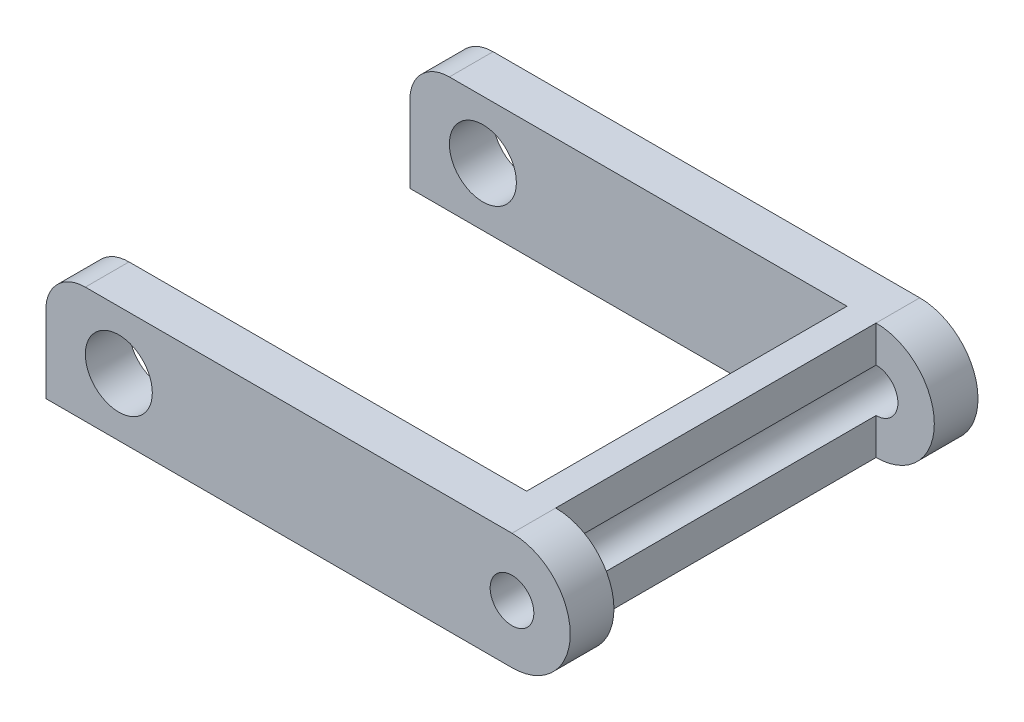
ISO-10303-21;
HEADER;
FILE_DESCRIPTION(('STEP AP214'),'2;1');
FILE_NAME('part.step','',(''),(''),'','','');
FILE_SCHEMA(('AUTOMOTIVE_DESIGN { 1 0 10303 214 1 1 1 1 }'));
ENDSEC;
DATA;
#1=APPLICATION_CONTEXT('core data for automotive mechanical design processes');
#2=APPLICATION_PROTOCOL_DEFINITION('international standard','automotive_design',2000,#1);
#3=PRODUCT_CONTEXT('',#1,'mechanical');
#4=PRODUCT('Part','Part','',(#3));
#5=PRODUCT_RELATED_PRODUCT_CATEGORY('part','',(#4));
#6=PRODUCT_DEFINITION_FORMATION('','',#4);
#7=PRODUCT_DEFINITION_CONTEXT('part definition',#1,'design');
#8=PRODUCT_DEFINITION('design','',#6,#7);
#9=PRODUCT_DEFINITION_SHAPE('','',#8);
#10=(LENGTH_UNIT() NAMED_UNIT(*) SI_UNIT(.MILLI.,.METRE.));
#11=(NAMED_UNIT(*) PLANE_ANGLE_UNIT() SI_UNIT($,.RADIAN.));
#12=(NAMED_UNIT(*) SI_UNIT($,.STERADIAN.) SOLID_ANGLE_UNIT());
#13=UNCERTAINTY_MEASURE_WITH_UNIT(LENGTH_MEASURE(1.E-05),#10,'distance_accuracy_value','');
#14=(GEOMETRIC_REPRESENTATION_CONTEXT(3) GLOBAL_UNCERTAINTY_ASSIGNED_CONTEXT((#13)) GLOBAL_UNIT_ASSIGNED_CONTEXT((#10,
#11,#12)) REPRESENTATION_CONTEXT('',''));
#15=CARTESIAN_POINT('',(0.,0.,0.));
#16=DIRECTION('',(0.,0.,1.));
#17=DIRECTION('',(1.,0.,0.));
#18=AXIS2_PLACEMENT_3D('',#15,#16,#17);
#19=CARTESIAN_POINT('',(-14.6493035395222,0.635050337685843,-14.0000004321337));
#20=DIRECTION('',(0.,0.,1.));
#21=DIRECTION('',(1.,0.,0.));
#22=AXIS2_PLACEMENT_3D('',#19,#20,#21);
#23=CYLINDRICAL_SURFACE('',#22,1.35743104424977);
#24=DIRECTION('',(0.,0.,1.));
#25=VECTOR('',#24,1.);
#26=CARTESIAN_POINT('',(-15.9999998286366,0.770100604125558,-14.0000004321337));
#27=LINE('',#26,#25);
#28=CARTESIAN_POINT('',(-15.9999998286366,0.770100604125558,-14.0000004321337));
#29=VERTEX_POINT('',#28);
#30=CARTESIAN_POINT('',(-15.9999998286366,0.770100604125558,-12.5000001862645));
#31=VERTEX_POINT('',#30);
#32=EDGE_CURVE('E162',#29,#31,#27,.T.);
#33=ORIENTED_EDGE('',*,*,#32,.T.);
#34=CARTESIAN_POINT('',(-14.6493035395222,0.635050337685843,-12.5000001862645));
#35=DIRECTION('',(0.,0.,1.));
#36=DIRECTION('',(1.,0.,0.));
#37=AXIS2_PLACEMENT_3D('',#34,#35,#36);
#38=CIRCLE('',#37,1.35743104424977);
#39=CARTESIAN_POINT('',(-14.6500002160669,1.99248120315739,-12.5000001862645));
#40=VERTEX_POINT('',#39);
#41=EDGE_CURVE('E163',#31,#40,#38,.F.);
#42=ORIENTED_EDGE('',*,*,#41,.T.);
#43=DIRECTION('',(0.,0.,1.));
#44=VECTOR('',#43,1.);
#45=CARTESIAN_POINT('',(-14.6500002160669,1.99248120315739,-14.0000004321337));
#46=LINE('',#45,#44);
#47=CARTESIAN_POINT('',(-14.6500002160669,1.99248120315739,-14.0000004321337));
#48=VERTEX_POINT('',#47);
#49=EDGE_CURVE('E182',#48,#40,#46,.T.);
#50=ORIENTED_EDGE('',*,*,#49,.F.);
#51=CARTESIAN_POINT('',(-14.6493035395222,0.635050337685843,-14.0000004321337));
#52=DIRECTION('',(0.,0.,1.));
#53=DIRECTION('',(1.,0.,0.));
#54=AXIS2_PLACEMENT_3D('',#51,#52,#53);
#55=CIRCLE('',#54,1.35743104424977);
#56=EDGE_CURVE('E181',#48,#29,#55,.T.);
#57=ORIENTED_EDGE('',*,*,#56,.T.);
#58=EDGE_LOOP('',(#33,#42,#50,#57));
#59=FACE_BOUND('',#58,.T.);
#60=ADVANCED_FACE('F43',(#59),#23,.T.);
#61=CARTESIAN_POINT('',(-14.6493035395222,0.635050337685843,-1.50000024586917));
#62=DIRECTION('',(0.,0.,-1.));
#63=DIRECTION('',(-1.,0.,0.));
#64=AXIS2_PLACEMENT_3D('',#61,#62,#63);
#65=CIRCLE('',#64,1.35743104424977);
#66=CARTESIAN_POINT('',(-14.6500002160669,1.99248120315739,-1.50000024586917));
#67=VERTEX_POINT('',#66);
#68=CARTESIAN_POINT('',(-15.9999998286366,0.770100604125558,-1.50000024586917));
#69=VERTEX_POINT('',#68);
#70=EDGE_CURVE('E161',#67,#69,#65,.F.);
#71=ORIENTED_EDGE('',*,*,#70,.T.);
#72=DIRECTION('',(0.,0.,1.));
#73=VECTOR('',#72,1.);
#74=CARTESIAN_POINT('',(-15.9999998286366,0.770100604125558,-14.0000004321337));
#75=LINE('',#74,#73);
#76=CARTESIAN_POINT('',(-15.9999998286366,0.770100604125558,0.));
#77=VERTEX_POINT('',#76);
#78=EDGE_CURVE('E145',#69,#77,#75,.T.);
#79=ORIENTED_EDGE('',*,*,#78,.T.);
#80=CARTESIAN_POINT('',(-14.6493035395222,0.635050337685843,0.));
#81=DIRECTION('',(0.,0.,1.));
#82=DIRECTION('',(1.,0.,0.));
#83=AXIS2_PLACEMENT_3D('',#80,#81,#82);
#84=CIRCLE('',#83,1.35743104424977);
#85=CARTESIAN_POINT('',(-14.6500002160669,1.99248120315739,0.));
#86=VERTEX_POINT('',#85);
#87=EDGE_CURVE('E154',#86,#77,#84,.T.);
#88=ORIENTED_EDGE('',*,*,#87,.F.);
#89=EDGE_CURVE('E186',#67,#86,#46,.T.);
#90=ORIENTED_EDGE('',*,*,#89,.F.);
#91=EDGE_LOOP('',(#71,#79,#88,#90));
#92=FACE_BOUND('',#91,.T.);
#93=ADVANCED_FACE('F158',(#92),#23,.T.);
#94=CARTESIAN_POINT('',(-14.6500002160669,1.99248120315739,-14.0000004321337));
#95=DIRECTION('',(-0.000513231627973449,0.999999868296639,0.));
#96=DIRECTION('',(-0.999999868296639,-0.000513231627973449,0.));
#97=AXIS2_PLACEMENT_3D('',#94,#95,#96);
#98=PLANE('',#97);
#99=ORIENTED_EDGE('',*,*,#49,.T.);
#100=DIRECTION('',(0.999999868296639,0.000513231627973449,0.));
#101=VECTOR('',#100,1.);
#102=CARTESIAN_POINT('',(-14.6500002160669,1.99248120315739,-12.5000001862645));
#103=LINE('',#102,#101);
#104=CARTESIAN_POINT('',(-1.00000016391277,1.99948681582866,-12.5000001862645));
#105=VERTEX_POINT('',#104);
#106=EDGE_CURVE('E214',#40,#105,#103,.T.);
#107=ORIENTED_EDGE('',*,*,#106,.T.);
#108=DIRECTION('',(0.,0.,1.));
#109=VECTOR('',#108,1.);
#110=CARTESIAN_POINT('',(-1.00000016391277,1.99948681582866,-14.0000004321337));
#111=LINE('',#110,#109);
#112=CARTESIAN_POINT('',(-1.00000016391277,1.99948681582866,-1.50000024586916));
#113=VERTEX_POINT('',#112);
#114=EDGE_CURVE('E228',#105,#113,#111,.T.);
#115=ORIENTED_EDGE('',*,*,#114,.T.);
#116=DIRECTION('',(-0.999999868296639,-0.000513231627973449,0.));
#117=VECTOR('',#116,1.);
#118=CARTESIAN_POINT('',(-14.6500002160669,1.99248120315739,-1.50000024586917));
#119=LINE('',#118,#117);
#120=EDGE_CURVE('E216',#113,#67,#119,.T.);
#121=ORIENTED_EDGE('',*,*,#120,.T.);
#122=ORIENTED_EDGE('',*,*,#89,.T.);
#123=DIRECTION('',(-0.999999868296639,-0.000513231627973449,0.));
#124=VECTOR('',#123,1.);
#125=CARTESIAN_POINT('',(-14.6500002160669,1.99248120315739,0.));
#126=LINE('',#125,#124);
#127=CARTESIAN_POINT('',(-2.1606684497133E-07,2.00000004749746,0.));
#128=VERTEX_POINT('',#127);
#129=EDGE_CURVE('E167',#128,#86,#126,.T.);
#130=ORIENTED_EDGE('',*,*,#129,.F.);
#131=DIRECTION('',(0.,0.,1.));
#132=VECTOR('',#131,1.);
#133=CARTESIAN_POINT('',(-2.1606684497133E-07,2.00000004749746,-14.0000004321337));
#134=LINE('',#133,#132);
#135=CARTESIAN_POINT('',(0.,2.00000004749746,-1.50000024586916));
#136=VERTEX_POINT('',#135);
#137=EDGE_CURVE('E190',#136,#128,#134,.T.);
#138=ORIENTED_EDGE('',*,*,#137,.F.);
#139=DIRECTION('',(0.,0.,1.));
#140=VECTOR('',#139,1.);
#141=CARTESIAN_POINT('',(0.,2.00000004749746,-14.0000004321337));
#142=LINE('',#141,#140);
#143=CARTESIAN_POINT('',(0.,2.00000004749746,-12.5000001862645));
#144=VERTEX_POINT('',#143);
#145=EDGE_CURVE('E290',#136,#144,#142,.F.);
#146=ORIENTED_EDGE('',*,*,#145,.T.);
#147=CARTESIAN_POINT('',(-2.1606684497133E-07,2.00000004749746,-14.0000004321337));
#148=VERTEX_POINT('',#147);
#149=EDGE_CURVE('E187',#148,#144,#134,.T.);
#150=ORIENTED_EDGE('',*,*,#149,.F.);
#151=DIRECTION('',(-0.999999868296639,-0.000513231627973449,0.));
#152=VECTOR('',#151,1.);
#153=CARTESIAN_POINT('',(-14.6500002160669,1.99248120315739,-14.0000004321337));
#154=LINE('',#153,#152);
#155=EDGE_CURVE('E174',#148,#48,#154,.T.);
#156=ORIENTED_EDGE('',*,*,#155,.T.);
#157=EDGE_LOOP('',(#99,#107,#115,#121,#122,#130,#138,#146,#150,#156));
#158=FACE_BOUND('',#157,.T.);
#159=ADVANCED_FACE('F253',(#158),#98,.T.);
#160=CARTESIAN_POINT('',(0.,0.,-14.0000004321337));
#161=DIRECTION('',(0.,0.,1.));
#162=DIRECTION('',(1.,0.,0.));
#163=AXIS2_PLACEMENT_3D('',#160,#161,#162);
#164=CYLINDRICAL_SURFACE('',#163,2.00000004749746);
#165=CARTESIAN_POINT('',(0.,0.,-14.0000004321337));
#166=DIRECTION('',(0.,0.,1.));
#167=DIRECTION('',(1.,0.,0.));
#168=AXIS2_PLACEMENT_3D('',#165,#166,#167);
#169=CIRCLE('',#168,2.00000004749746);
#170=CARTESIAN_POINT('',(0.,-2.00000004749746,-14.0000004321337));
#171=VERTEX_POINT('',#170);
#172=EDGE_CURVE('E246',#171,#148,#169,.T.);
#173=ORIENTED_EDGE('',*,*,#172,.T.);
#174=ORIENTED_EDGE('',*,*,#149,.T.);
#175=CARTESIAN_POINT('',(0.,0.,-12.5000001862645));
#176=DIRECTION('',(0.,0.,1.));
#177=DIRECTION('',(1.,0.,0.));
#178=AXIS2_PLACEMENT_3D('',#175,#176,#177);
#179=CIRCLE('',#178,2.00000004749746);
#180=CARTESIAN_POINT('',(0.,-2.00000004749745,-12.5000001862645));
#181=VERTEX_POINT('',#180);
#182=EDGE_CURVE('E207',#144,#181,#179,.F.);
#183=ORIENTED_EDGE('',*,*,#182,.T.);
#184=DIRECTION('',(0.,0.,1.));
#185=VECTOR('',#184,1.);
#186=CARTESIAN_POINT('',(0.,-2.00000004749746,-14.0000004321337));
#187=LINE('',#186,#185);
#188=EDGE_CURVE('E191',#171,#181,#187,.T.);
#189=ORIENTED_EDGE('',*,*,#188,.F.);
#190=EDGE_LOOP('',(#173,#174,#183,#189));
#191=FACE_BOUND('',#190,.T.);
#192=ADVANCED_FACE('F323',(#191),#164,.T.);
#193=ORIENTED_EDGE('',*,*,#137,.T.);
#194=CARTESIAN_POINT('',(0.,0.,0.));
#195=DIRECTION('',(0.,0.,1.));
#196=DIRECTION('',(1.,0.,0.));
#197=AXIS2_PLACEMENT_3D('',#194,#195,#196);
#198=CIRCLE('',#197,2.00000004749746);
#199=CARTESIAN_POINT('',(0.,-2.00000004749746,0.));
#200=VERTEX_POINT('',#199);
#201=EDGE_CURVE('E178',#200,#128,#198,.T.);
#202=ORIENTED_EDGE('',*,*,#201,.F.);
#203=CARTESIAN_POINT('',(0.,-2.00000004749746,-1.50000024586916));
#204=VERTEX_POINT('',#203);
#205=EDGE_CURVE('E194',#204,#200,#187,.T.);
#206=ORIENTED_EDGE('',*,*,#205,.F.);
#207=CARTESIAN_POINT('',(0.,0.,-1.50000024586916));
#208=DIRECTION('',(0.,0.,-1.));
#209=DIRECTION('',(-1.,0.,0.));
#210=AXIS2_PLACEMENT_3D('',#207,#208,#209);
#211=CIRCLE('',#210,2.00000004749746);
#212=EDGE_CURVE('E268',#204,#136,#211,.F.);
#213=ORIENTED_EDGE('',*,*,#212,.T.);
#214=EDGE_LOOP('',(#193,#202,#206,#213));
#215=FACE_BOUND('',#214,.T.);
#216=ADVANCED_FACE('F307',(#215),#164,.T.);
#217=CARTESIAN_POINT('',(-15.9999998286366,-2.00000004749745,-14.0000004321337));
#218=DIRECTION('',(0.,-1.,0.));
#219=DIRECTION('',(0.,0.,-1.));
#220=AXIS2_PLACEMENT_3D('',#217,#218,#219);
#221=PLANE('',#220);
#222=DIRECTION('',(0.,0.,-1.));
#223=VECTOR('',#222,1.);
#224=CARTESIAN_POINT('',(-1.00000016391277,-2.00000004749745,-14.0000004321337));
#225=LINE('',#224,#223);
#226=CARTESIAN_POINT('',(-1.00000016391277,-2.00000004749745,-1.50000024586916));
#227=VERTEX_POINT('',#226);
#228=CARTESIAN_POINT('',(-1.00000016391277,-2.00000004749745,-12.5000001862645));
#229=VERTEX_POINT('',#228);
#230=EDGE_CURVE('E12',#227,#229,#225,.T.);
#231=ORIENTED_EDGE('',*,*,#230,.T.);
#232=DIRECTION('',(-1.,0.,0.));
#233=VECTOR('',#232,1.);
#234=CARTESIAN_POINT('',(-15.9999998286366,-2.00000004749745,-12.5000001862645));
#235=LINE('',#234,#233);
#236=CARTESIAN_POINT('',(-15.9999998286366,-2.00000004749745,-12.5000001862645));
#237=VERTEX_POINT('',#236);
#238=EDGE_CURVE('E210',#229,#237,#235,.T.);
#239=ORIENTED_EDGE('',*,*,#238,.T.);
#240=DIRECTION('',(0.,0.,1.));
#241=VECTOR('',#240,1.);
#242=CARTESIAN_POINT('',(-15.9999998286366,-2.00000004749745,-14.0000004321337));
#243=LINE('',#242,#241);
#244=CARTESIAN_POINT('',(-15.9999998286366,-2.00000004749745,-14.0000004321337));
#245=VERTEX_POINT('',#244);
#246=EDGE_CURVE('E195',#245,#237,#243,.T.);
#247=ORIENTED_EDGE('',*,*,#246,.F.);
#248=DIRECTION('',(1.,0.,0.));
#249=VECTOR('',#248,1.);
#250=CARTESIAN_POINT('',(-15.9999998286366,-2.00000004749745,-14.0000004321337));
#251=LINE('',#250,#249);
#252=EDGE_CURVE('E244',#245,#171,#251,.T.);
#253=ORIENTED_EDGE('',*,*,#252,.T.);
#254=ORIENTED_EDGE('',*,*,#188,.T.);
#255=DIRECTION('',(0.,0.,1.));
#256=VECTOR('',#255,1.);
#257=CARTESIAN_POINT('',(0.,-2.00000004749745,-14.0000004321337));
#258=LINE('',#257,#256);
#259=EDGE_CURVE('E271',#181,#204,#258,.T.);
#260=ORIENTED_EDGE('',*,*,#259,.T.);
#261=ORIENTED_EDGE('',*,*,#205,.T.);
#262=DIRECTION('',(1.,0.,0.));
#263=VECTOR('',#262,1.);
#264=CARTESIAN_POINT('',(-15.9999998286366,-2.00000004749745,0.));
#265=LINE('',#264,#263);
#266=CARTESIAN_POINT('',(-15.9999998286366,-2.00000004749745,0.));
#267=VERTEX_POINT('',#266);
#268=EDGE_CURVE('E153',#267,#200,#265,.T.);
#269=ORIENTED_EDGE('',*,*,#268,.F.);
#270=CARTESIAN_POINT('',(-15.9999998286366,-2.00000004749745,-1.50000024586917));
#271=VERTEX_POINT('',#270);
#272=EDGE_CURVE('E148',#271,#267,#243,.T.);
#273=ORIENTED_EDGE('',*,*,#272,.F.);
#274=DIRECTION('',(1.,0.,0.));
#275=VECTOR('',#274,1.);
#276=CARTESIAN_POINT('',(-15.9999998286367,-2.00000004749745,-1.50000024586917));
#277=LINE('',#276,#275);
#278=EDGE_CURVE('E206',#271,#227,#277,.T.);
#279=ORIENTED_EDGE('',*,*,#278,.T.);
#280=EDGE_LOOP('',(#231,#239,#247,#253,#254,#260,#261,#269,#273,#279));
#281=FACE_BOUND('',#280,.T.);
#282=ADVANCED_FACE('F294',(#281),#221,.T.);
#283=CARTESIAN_POINT('',(-15.9999998286366,0.500000071246183,-14.0000004321337));
#284=DIRECTION('',(-1.,0.,0.));
#285=DIRECTION('',(0.,0.,1.));
#286=AXIS2_PLACEMENT_3D('',#283,#284,#285);
#287=PLANE('',#286);
#288=ORIENTED_EDGE('',*,*,#246,.T.);
#289=DIRECTION('',(0.,1.,0.));
#290=VECTOR('',#289,1.);
#291=CARTESIAN_POINT('',(-15.9999998286366,-19.4603503456678,-12.5000001862645));
#292=LINE('',#291,#290);
#293=EDGE_CURVE('E264',#237,#31,#292,.T.);
#294=ORIENTED_EDGE('',*,*,#293,.T.);
#295=ORIENTED_EDGE('',*,*,#32,.F.);
#296=DIRECTION('',(0.,-1.,0.));
#297=VECTOR('',#296,1.);
#298=CARTESIAN_POINT('',(-15.9999998286366,0.500000071246183,-14.0000004321337));
#299=LINE('',#298,#297);
#300=EDGE_CURVE('E241',#29,#245,#299,.T.);
#301=ORIENTED_EDGE('',*,*,#300,.T.);
#302=EDGE_LOOP('',(#288,#294,#295,#301));
#303=FACE_BOUND('',#302,.T.);
#304=ADVANCED_FACE('F267',(#303),#287,.T.);
#305=DIRECTION('',(0.,-1.,0.));
#306=VECTOR('',#305,1.);
#307=CARTESIAN_POINT('',(-15.9999998286366,0.500000071246183,0.));
#308=LINE('',#307,#306);
#309=EDGE_CURVE('E141',#77,#267,#308,.T.);
#310=ORIENTED_EDGE('',*,*,#309,.F.);
#311=ORIENTED_EDGE('',*,*,#78,.F.);
#312=DIRECTION('',(0.,1.,0.));
#313=VECTOR('',#312,1.);
#314=CARTESIAN_POINT('',(-15.9999998286366,-19.4603503456678,-1.50000024586917));
#315=LINE('',#314,#313);
#316=EDGE_CURVE('E281',#271,#69,#315,.T.);
#317=ORIENTED_EDGE('',*,*,#316,.F.);
#318=ORIENTED_EDGE('',*,*,#272,.T.);
#319=EDGE_LOOP('',(#310,#311,#317,#318));
#320=FACE_BOUND('',#319,.T.);
#321=ADVANCED_FACE('F143',(#320),#287,.T.);
#322=CARTESIAN_POINT('',(-14.6493035395222,0.635050337685843,-14.0000004321337));
#323=DIRECTION('',(0.,0.,1.));
#324=DIRECTION('',(1.,0.,0.));
#325=AXIS2_PLACEMENT_3D('',#322,#323,#324);
#326=PLANE('',#325);
#327=CARTESIAN_POINT('',(-13.5000002160668,4.74974573561049E-08,-14.0000004321337));
#328=DIRECTION('',(0.,0.,1.));
#329=DIRECTION('',(1.,0.,0.));
#330=AXIS2_PLACEMENT_3D('',#327,#328,#329);
#331=CIRCLE('',#330,1.15);
#332=CARTESIAN_POINT('',(-12.3500002160668,4.74974573561049E-08,-14.0000004321337));
#333=VERTEX_POINT('',#332);
#334=EDGE_CURVE('E168',#333,#333,#331,.T.);
#335=ORIENTED_EDGE('',*,*,#334,.T.);
#336=EDGE_LOOP('',(#335));
#337=FACE_BOUND('',#336,.T.);
#338=CARTESIAN_POINT('',(0.,0.,-14.0000004321337));
#339=DIRECTION('',(0.,0.,1.));
#340=DIRECTION('',(1.,0.,0.));
#341=AXIS2_PLACEMENT_3D('',#338,#339,#340);
#342=CIRCLE('',#341,0.749999783933157);
#343=CARTESIAN_POINT('',(0.749999783933157,0.,-14.0000004321337));
#344=VERTEX_POINT('',#343);
#345=EDGE_CURVE('E232',#344,#344,#342,.T.);
#346=ORIENTED_EDGE('',*,*,#345,.T.);
#347=EDGE_LOOP('',(#346));
#348=FACE_BOUND('',#347,.T.);
#349=ORIENTED_EDGE('',*,*,#300,.F.);
#350=ORIENTED_EDGE('',*,*,#56,.F.);
#351=ORIENTED_EDGE('',*,*,#155,.F.);
#352=ORIENTED_EDGE('',*,*,#172,.F.);
#353=ORIENTED_EDGE('',*,*,#252,.F.);
#354=EDGE_LOOP('',(#349,#350,#351,#352,#353));
#355=FACE_BOUND('',#354,.T.);
#356=ADVANCED_FACE('F257',(#337,#348,#355),#326,.F.);
#357=CARTESIAN_POINT('',(-14.6493035395222,0.635050337685843,0.));
#358=DIRECTION('',(0.,0.,1.));
#359=DIRECTION('',(1.,0.,0.));
#360=AXIS2_PLACEMENT_3D('',#357,#358,#359);
#361=PLANE('',#360);
#362=CARTESIAN_POINT('',(0.,0.,0.));
#363=DIRECTION('',(0.,0.,1.));
#364=DIRECTION('',(1.,0.,0.));
#365=AXIS2_PLACEMENT_3D('',#362,#363,#364);
#366=CIRCLE('',#365,0.749999783933157);
#367=CARTESIAN_POINT('',(0.749999783933157,0.,0.));
#368=VERTEX_POINT('',#367);
#369=EDGE_CURVE('E231',#368,#368,#366,.T.);
#370=ORIENTED_EDGE('',*,*,#369,.F.);
#371=EDGE_LOOP('',(#370));
#372=FACE_BOUND('',#371,.T.);
#373=CARTESIAN_POINT('',(-13.5000002160668,4.74974573561049E-08,0.));
#374=DIRECTION('',(0.,0.,1.));
#375=DIRECTION('',(1.,0.,0.));
#376=AXIS2_PLACEMENT_3D('',#373,#374,#375);
#377=CIRCLE('',#376,1.15);
#378=CARTESIAN_POINT('',(-12.3500002160668,4.74974573561049E-08,0.));
#379=VERTEX_POINT('',#378);
#380=EDGE_CURVE('E171',#379,#379,#377,.T.);
#381=ORIENTED_EDGE('',*,*,#380,.F.);
#382=EDGE_LOOP('',(#381));
#383=FACE_BOUND('',#382,.T.);
#384=ORIENTED_EDGE('',*,*,#87,.T.);
#385=ORIENTED_EDGE('',*,*,#309,.T.);
#386=ORIENTED_EDGE('',*,*,#268,.T.);
#387=ORIENTED_EDGE('',*,*,#201,.T.);
#388=ORIENTED_EDGE('',*,*,#129,.T.);
#389=EDGE_LOOP('',(#384,#385,#386,#387,#388));
#390=FACE_BOUND('',#389,.T.);
#391=ADVANCED_FACE('F165',(#372,#383,#390),#361,.T.);
#392=CARTESIAN_POINT('',(-13.5000002160668,4.74974573561049E-08,-14.0000004321337));
#393=DIRECTION('',(0.,0.,1.));
#394=DIRECTION('',(1.,0.,0.));
#395=AXIS2_PLACEMENT_3D('',#392,#393,#394);
#396=CYLINDRICAL_SURFACE('',#395,1.15);
#397=ORIENTED_EDGE('',*,*,#334,.F.);
#398=EDGE_LOOP('',(#397));
#399=FACE_BOUND('',#398,.T.);
#400=CARTESIAN_POINT('',(-13.5000002160668,4.74974573561049E-08,-12.5000001862645));
#401=DIRECTION('',(0.,0.,1.));
#402=DIRECTION('',(1.,0.,0.));
#403=AXIS2_PLACEMENT_3D('',#400,#401,#402);
#404=CIRCLE('',#403,1.15);
#405=CARTESIAN_POINT('',(-12.3500002160668,4.74974573561049E-08,-12.5000001862645));
#406=VERTEX_POINT('',#405);
#407=EDGE_CURVE('E208',#406,#406,#404,.F.);
#408=ORIENTED_EDGE('',*,*,#407,.F.);
#409=EDGE_LOOP('',(#408));
#410=FACE_BOUND('',#409,.T.);
#411=ADVANCED_FACE('F360',(#399,#410),#396,.F.);
#412=ORIENTED_EDGE('',*,*,#380,.T.);
#413=EDGE_LOOP('',(#412));
#414=FACE_BOUND('',#413,.T.);
#415=CARTESIAN_POINT('',(-13.5000002160668,4.74974573561049E-08,-1.50000024586917));
#416=DIRECTION('',(0.,0.,-1.));
#417=DIRECTION('',(-1.,0.,0.));
#418=AXIS2_PLACEMENT_3D('',#415,#416,#417);
#419=CIRCLE('',#418,1.15);
#420=CARTESIAN_POINT('',(-14.6500002160668,4.74974573561049E-08,-1.50000024586917));
#421=VERTEX_POINT('',#420);
#422=EDGE_CURVE('E204',#421,#421,#419,.F.);
#423=ORIENTED_EDGE('',*,*,#422,.F.);
#424=EDGE_LOOP('',(#423));
#425=FACE_BOUND('',#424,.T.);
#426=ADVANCED_FACE('F366',(#414,#425),#396,.F.);
#427=CARTESIAN_POINT('',(0.,0.,-14.0000004321337));
#428=DIRECTION('',(0.,0.,1.));
#429=DIRECTION('',(1.,0.,0.));
#430=AXIS2_PLACEMENT_3D('',#427,#428,#429);
#431=CYLINDRICAL_SURFACE('',#430,0.749999783933157);
#432=ORIENTED_EDGE('',*,*,#369,.T.);
#433=EDGE_LOOP('',(#432));
#434=FACE_BOUND('',#433,.T.);
#435=ORIENTED_EDGE('',*,*,#345,.F.);
#436=EDGE_LOOP('',(#435));
#437=FACE_BOUND('',#436,.T.);
#438=CARTESIAN_POINT('',(0.,0.,-12.5000001862645));
#439=DIRECTION('',(0.,0.,1.));
#440=DIRECTION('',(1.,0.,0.));
#441=AXIS2_PLACEMENT_3D('',#438,#439,#440);
#442=CIRCLE('',#441,0.749999783933157);
#443=CARTESIAN_POINT('',(0.,0.749999783933156,-12.5000001862645));
#444=VERTEX_POINT('',#443);
#445=CARTESIAN_POINT('',(0.,-0.749999783933156,-12.5000001862645));
#446=VERTEX_POINT('',#445);
#447=EDGE_CURVE('E50',#444,#446,#442,.F.);
#448=ORIENTED_EDGE('',*,*,#447,.F.);
#449=DIRECTION('',(0.,0.,1.));
#450=VECTOR('',#449,1.);
#451=CARTESIAN_POINT('',(0.,0.749999783933157,-14.0000004321337));
#452=LINE('',#451,#450);
#453=CARTESIAN_POINT('',(0.,0.749999783933157,-1.50000024586916));
#454=VERTEX_POINT('',#453);
#455=EDGE_CURVE('E201',#454,#444,#452,.F.);
#456=ORIENTED_EDGE('',*,*,#455,.F.);
#457=CARTESIAN_POINT('',(0.,0.,-1.50000024586916));
#458=DIRECTION('',(0.,0.,-1.));
#459=DIRECTION('',(-1.,0.,0.));
#460=AXIS2_PLACEMENT_3D('',#457,#458,#459);
#461=CIRCLE('',#460,0.749999783933157);
#462=CARTESIAN_POINT('',(0.,-0.749999783933157,-1.50000024586916));
#463=VERTEX_POINT('',#462);
#464=EDGE_CURVE('E185',#463,#454,#461,.F.);
#465=ORIENTED_EDGE('',*,*,#464,.F.);
#466=DIRECTION('',(0.,0.,1.));
#467=VECTOR('',#466,1.);
#468=CARTESIAN_POINT('',(0.,-0.749999783933157,-14.0000004321337));
#469=LINE('',#468,#467);
#470=EDGE_CURVE('E199',#446,#463,#469,.T.);
#471=ORIENTED_EDGE('',*,*,#470,.F.);
#472=EDGE_LOOP('',(#448,#456,#465,#471));
#473=FACE_BOUND('',#472,.T.);
#474=ADVANCED_FACE('F319',(#434,#437,#473),#431,.F.);
#475=CARTESIAN_POINT('',(0.,-19.4603503456678,-1.50000024586916));
#476=DIRECTION('',(0.,0.,-1.));
#477=DIRECTION('',(-1.,0.,0.));
#478=AXIS2_PLACEMENT_3D('',#475,#476,#477);
#479=PLANE('',#478);
#480=DIRECTION('',(0.,1.,0.));
#481=VECTOR('',#480,1.);
#482=CARTESIAN_POINT('',(0.,-19.4603503456678,-1.50000024586916));
#483=LINE('',#482,#481);
#484=EDGE_CURVE('E57',#204,#463,#483,.T.);
#485=ORIENTED_EDGE('',*,*,#484,.T.);
#486=ORIENTED_EDGE('',*,*,#464,.T.);
#487=EDGE_CURVE('E278',#454,#136,#483,.T.);
#488=ORIENTED_EDGE('',*,*,#487,.T.);
#489=ORIENTED_EDGE('',*,*,#212,.F.);
#490=EDGE_LOOP('',(#485,#486,#488,#489));
#491=FACE_BOUND('',#490,.T.);
#492=ADVANCED_FACE('F314',(#491),#479,.T.);
#493=CARTESIAN_POINT('',(0.,-19.4603503456678,-12.5000001862645));
#494=DIRECTION('',(1.,0.,0.));
#495=DIRECTION('',(0.,0.,-1.));
#496=AXIS2_PLACEMENT_3D('',#493,#494,#495);
#497=PLANE('',#496);
#498=DIRECTION('',(0.,1.,0.));
#499=VECTOR('',#498,1.);
#500=CARTESIAN_POINT('',(0.,-19.4603503456678,-12.5000001862645));
#501=LINE('',#500,#499);
#502=EDGE_CURVE('E269',#181,#446,#501,.T.);
#503=ORIENTED_EDGE('',*,*,#502,.T.);
#504=ORIENTED_EDGE('',*,*,#470,.T.);
#505=ORIENTED_EDGE('',*,*,#484,.F.);
#506=ORIENTED_EDGE('',*,*,#259,.F.);
#507=EDGE_LOOP('',(#503,#504,#505,#506));
#508=FACE_BOUND('',#507,.T.);
#509=ADVANCED_FACE('F324',(#508),#497,.T.);
#510=ORIENTED_EDGE('',*,*,#487,.F.);
#511=ORIENTED_EDGE('',*,*,#455,.T.);
#512=EDGE_CURVE('E274',#444,#144,#501,.T.);
#513=ORIENTED_EDGE('',*,*,#512,.T.);
#514=ORIENTED_EDGE('',*,*,#145,.F.);
#515=EDGE_LOOP('',(#510,#511,#513,#514));
#516=FACE_BOUND('',#515,.T.);
#517=ADVANCED_FACE('F311',(#516),#497,.T.);
#518=CARTESIAN_POINT('',(1.99999939650297,-19.4603503456678,-12.5000001862645));
#519=DIRECTION('',(0.,0.,1.));
#520=DIRECTION('',(1.,0.,0.));
#521=AXIS2_PLACEMENT_3D('',#518,#519,#520);
#522=PLANE('',#521);
#523=ORIENTED_EDGE('',*,*,#182,.F.);
#524=ORIENTED_EDGE('',*,*,#512,.F.);
#525=ORIENTED_EDGE('',*,*,#447,.T.);
#526=ORIENTED_EDGE('',*,*,#502,.F.);
#527=EDGE_LOOP('',(#523,#524,#525,#526));
#528=FACE_BOUND('',#527,.T.);
#529=ADVANCED_FACE('F321',(#528),#522,.T.);
#530=CARTESIAN_POINT('',(-5.50000020302832,-19.4603503456678,-12.5000001862645));
#531=DIRECTION('',(0.,0.,1.));
#532=DIRECTION('',(1.,0.,0.));
#533=AXIS2_PLACEMENT_3D('',#530,#531,#532);
#534=PLANE('',#533);
#535=ORIENTED_EDGE('',*,*,#293,.F.);
#536=ORIENTED_EDGE('',*,*,#238,.F.);
#537=DIRECTION('',(0.,1.,0.));
#538=VECTOR('',#537,1.);
#539=CARTESIAN_POINT('',(-1.00000016391277,-19.4603503456678,-12.5000001862645));
#540=LINE('',#539,#538);
#541=EDGE_CURVE('E286',#229,#105,#540,.T.);
#542=ORIENTED_EDGE('',*,*,#541,.T.);
#543=ORIENTED_EDGE('',*,*,#106,.F.);
#544=ORIENTED_EDGE('',*,*,#41,.F.);
#545=EDGE_LOOP('',(#535,#536,#542,#543,#544));
#546=FACE_BOUND('',#545,.T.);
#547=ORIENTED_EDGE('',*,*,#407,.T.);
#548=EDGE_LOOP('',(#547));
#549=FACE_BOUND('',#548,.T.);
#550=ADVANCED_FACE('F263',(#546,#549),#534,.T.);
#551=CARTESIAN_POINT('',(-15.9999998286366,-19.4603503456678,-1.50000024586917));
#552=DIRECTION('',(0.,0.,-1.));
#553=DIRECTION('',(-1.,0.,0.));
#554=AXIS2_PLACEMENT_3D('',#551,#552,#553);
#555=PLANE('',#554);
#556=ORIENTED_EDGE('',*,*,#120,.F.);
#557=DIRECTION('',(0.,1.,0.));
#558=VECTOR('',#557,1.);
#559=CARTESIAN_POINT('',(-1.00000016391277,-19.4603503456678,-1.50000024586916));
#560=LINE('',#559,#558);
#561=EDGE_CURVE('E283',#227,#113,#560,.T.);
#562=ORIENTED_EDGE('',*,*,#561,.F.);
#563=ORIENTED_EDGE('',*,*,#278,.F.);
#564=ORIENTED_EDGE('',*,*,#316,.T.);
#565=ORIENTED_EDGE('',*,*,#70,.F.);
#566=EDGE_LOOP('',(#556,#562,#563,#564,#565));
#567=FACE_BOUND('',#566,.T.);
#568=ORIENTED_EDGE('',*,*,#422,.T.);
#569=EDGE_LOOP('',(#568));
#570=FACE_BOUND('',#569,.T.);
#571=ADVANCED_FACE('F297',(#567,#570),#555,.T.);
#572=CARTESIAN_POINT('',(-1.00000016391277,-19.4603503456678,-1.50000024586916));
#573=DIRECTION('',(-1.,0.,0.));
#574=DIRECTION('',(0.,0.,1.));
#575=AXIS2_PLACEMENT_3D('',#572,#573,#574);
#576=PLANE('',#575);
#577=ORIENTED_EDGE('',*,*,#541,.F.);
#578=ORIENTED_EDGE('',*,*,#230,.F.);
#579=ORIENTED_EDGE('',*,*,#561,.T.);
#580=ORIENTED_EDGE('',*,*,#114,.F.);
#581=EDGE_LOOP('',(#577,#578,#579,#580));
#582=FACE_BOUND('',#581,.T.);
#583=ADVANCED_FACE('F301',(#582),#576,.T.);
#584=CLOSED_SHELL('',(#60,#93,#159,#192,#216,#282,#304,#321,#356,#391,#411,#426,#474,#492,#509,
#517,#529,#550,#571,#583));
#585=MANIFOLD_SOLID_BREP('B2',#584);
#586=ADVANCED_BREP_SHAPE_REPRESENTATION('',(#18,#585),#14);
#587=SHAPE_DEFINITION_REPRESENTATION(#9,#586);
ENDSEC;
END-ISO-10303-21;
